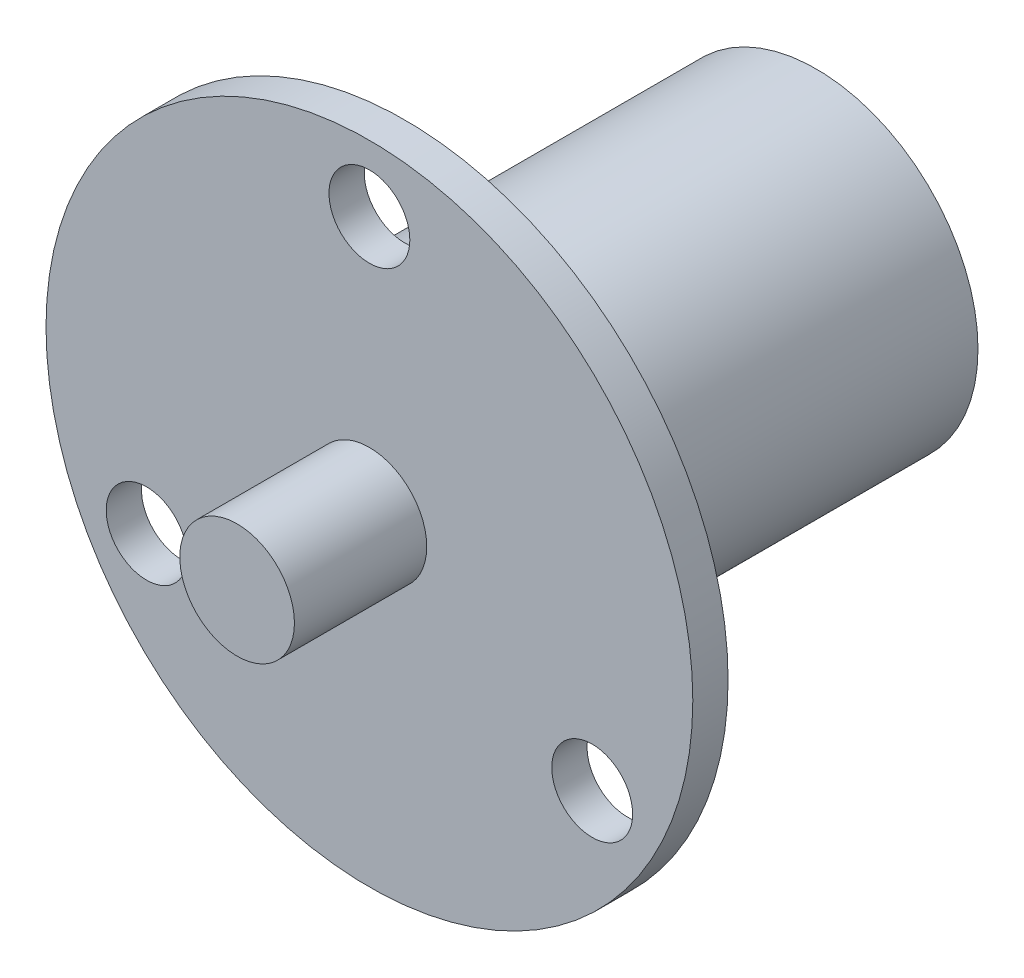
ISO-10303-21;
HEADER;
FILE_DESCRIPTION(('STEP AP214'),'2;1');
FILE_NAME('part.step','',(''),(''),'','','');
FILE_SCHEMA(('AUTOMOTIVE_DESIGN { 1 0 10303 214 1 1 1 1 }'));
ENDSEC;
DATA;
#1=APPLICATION_CONTEXT('core data for automotive mechanical design processes');
#2=APPLICATION_PROTOCOL_DEFINITION('international standard','automotive_design',2000,#1);
#3=PRODUCT_CONTEXT('',#1,'mechanical');
#4=PRODUCT('Part','Part','',(#3));
#5=PRODUCT_RELATED_PRODUCT_CATEGORY('part','',(#4));
#6=PRODUCT_DEFINITION_FORMATION('','',#4);
#7=PRODUCT_DEFINITION_CONTEXT('part definition',#1,'design');
#8=PRODUCT_DEFINITION('design','',#6,#7);
#9=PRODUCT_DEFINITION_SHAPE('','',#8);
#10=(LENGTH_UNIT() NAMED_UNIT(*) SI_UNIT(.MILLI.,.METRE.));
#11=(NAMED_UNIT(*) PLANE_ANGLE_UNIT() SI_UNIT($,.RADIAN.));
#12=(NAMED_UNIT(*) SI_UNIT($,.STERADIAN.) SOLID_ANGLE_UNIT());
#13=UNCERTAINTY_MEASURE_WITH_UNIT(LENGTH_MEASURE(1.E-05),#10,'distance_accuracy_value','');
#14=(GEOMETRIC_REPRESENTATION_CONTEXT(3) GLOBAL_UNCERTAINTY_ASSIGNED_CONTEXT((#13)) GLOBAL_UNIT_ASSIGNED_CONTEXT((#10,
#11,#12)) REPRESENTATION_CONTEXT('',''));
#15=CARTESIAN_POINT('',(0.,0.,0.));
#16=DIRECTION('',(0.,0.,1.));
#17=DIRECTION('',(1.,0.,0.));
#18=AXIS2_PLACEMENT_3D('',#15,#16,#17);
#19=CARTESIAN_POINT('',(0.,0.,-2.4));
#20=DIRECTION('',(0.,0.,1.));
#21=DIRECTION('',(1.,0.,0.));
#22=AXIS2_PLACEMENT_3D('',#19,#20,#21);
#23=PLANE('',#22);
#24=CARTESIAN_POINT('',(0.,0.,-2.4));
#25=DIRECTION('',(0.,0.,1.));
#26=DIRECTION('',(1.,0.,0.));
#27=AXIS2_PLACEMENT_3D('',#24,#25,#26);
#28=CIRCLE('',#27,22.);
#29=CARTESIAN_POINT('',(22.,0.,-2.4));
#30=VERTEX_POINT('',#29);
#31=EDGE_CURVE('E365',#30,#30,#28,.T.);
#32=ORIENTED_EDGE('',*,*,#31,.F.);
#33=EDGE_LOOP('',(#32));
#34=FACE_BOUND('',#33,.T.);
#35=CARTESIAN_POINT('',(0.,17.5,-2.4));
#36=DIRECTION('',(0.,0.,1.));
#37=DIRECTION('',(1.,0.,0.));
#38=AXIS2_PLACEMENT_3D('',#35,#36,#37);
#39=CIRCLE('',#38,2.75);
#40=CARTESIAN_POINT('',(2.75,17.5,-2.4));
#41=VERTEX_POINT('',#40);
#42=EDGE_CURVE('E373',#41,#41,#39,.T.);
#43=ORIENTED_EDGE('',*,*,#42,.T.);
#44=EDGE_LOOP('',(#43));
#45=FACE_BOUND('',#44,.T.);
#46=CARTESIAN_POINT('',(-15.1554445662276,-8.75000000000008,-2.4));
#47=DIRECTION('',(0.,0.,1.));
#48=DIRECTION('',(1.,0.,0.));
#49=AXIS2_PLACEMENT_3D('',#46,#47,#48);
#50=CIRCLE('',#49,2.75);
#51=CARTESIAN_POINT('',(-12.4054445662276,-8.75000000000008,-2.4));
#52=VERTEX_POINT('',#51);
#53=EDGE_CURVE('E381',#52,#52,#50,.T.);
#54=ORIENTED_EDGE('',*,*,#53,.T.);
#55=EDGE_LOOP('',(#54));
#56=FACE_BOUND('',#55,.T.);
#57=CARTESIAN_POINT('',(15.1554445662276,-8.75000000000007,-2.4));
#58=DIRECTION('',(0.,0.,1.));
#59=DIRECTION('',(1.,0.,0.));
#60=AXIS2_PLACEMENT_3D('',#57,#58,#59);
#61=CIRCLE('',#60,2.75);
#62=CARTESIAN_POINT('',(17.9054445662276,-8.75000000000007,-2.4));
#63=VERTEX_POINT('',#62);
#64=EDGE_CURVE('E387',#63,#63,#61,.T.);
#65=ORIENTED_EDGE('',*,*,#64,.T.);
#66=EDGE_LOOP('',(#65));
#67=FACE_BOUND('',#66,.T.);
#68=CARTESIAN_POINT('',(0.,0.,-2.4));
#69=DIRECTION('',(0.,0.,1.));
#70=DIRECTION('',(1.,0.,0.));
#71=AXIS2_PLACEMENT_3D('',#68,#69,#70);
#72=CIRCLE('',#71,11.);
#73=CARTESIAN_POINT('',(11.,0.,-2.4));
#74=VERTEX_POINT('',#73);
#75=EDGE_CURVE('E10',#74,#74,#72,.F.);
#76=ORIENTED_EDGE('',*,*,#75,.F.);
#77=EDGE_LOOP('',(#76));
#78=FACE_BOUND('',#77,.T.);
#79=ADVANCED_FACE('F358',(#34,#45,#56,#67,#78),#23,.F.);
#80=CARTESIAN_POINT('',(0.,0.,0.));
#81=DIRECTION('',(0.,0.,1.));
#82=DIRECTION('',(1.,0.,0.));
#83=AXIS2_PLACEMENT_3D('',#80,#81,#82);
#84=PLANE('',#83);
#85=CARTESIAN_POINT('',(0.,0.,0.));
#86=DIRECTION('',(0.,0.,1.));
#87=DIRECTION('',(1.,0.,0.));
#88=AXIS2_PLACEMENT_3D('',#85,#86,#87);
#89=CIRCLE('',#88,22.);
#90=CARTESIAN_POINT('',(22.,0.,0.));
#91=VERTEX_POINT('',#90);
#92=EDGE_CURVE('E369',#91,#91,#89,.T.);
#93=ORIENTED_EDGE('',*,*,#92,.T.);
#94=EDGE_LOOP('',(#93));
#95=FACE_BOUND('',#94,.T.);
#96=CARTESIAN_POINT('',(0.,17.5,0.));
#97=DIRECTION('',(0.,0.,1.));
#98=DIRECTION('',(1.,0.,0.));
#99=AXIS2_PLACEMENT_3D('',#96,#97,#98);
#100=CIRCLE('',#99,2.75);
#101=CARTESIAN_POINT('',(2.75,17.5,0.));
#102=VERTEX_POINT('',#101);
#103=EDGE_CURVE('E378',#102,#102,#100,.T.);
#104=ORIENTED_EDGE('',*,*,#103,.F.);
#105=EDGE_LOOP('',(#104));
#106=FACE_BOUND('',#105,.T.);
#107=CARTESIAN_POINT('',(-15.1554445662276,-8.75000000000008,0.));
#108=DIRECTION('',(0.,0.,1.));
#109=DIRECTION('',(1.,0.,0.));
#110=AXIS2_PLACEMENT_3D('',#107,#108,#109);
#111=CIRCLE('',#110,2.75);
#112=CARTESIAN_POINT('',(-12.4054445662276,-8.75000000000008,0.));
#113=VERTEX_POINT('',#112);
#114=EDGE_CURVE('E384',#113,#113,#111,.T.);
#115=ORIENTED_EDGE('',*,*,#114,.F.);
#116=EDGE_LOOP('',(#115));
#117=FACE_BOUND('',#116,.T.);
#118=CARTESIAN_POINT('',(15.1554445662276,-8.75000000000007,0.));
#119=DIRECTION('',(0.,0.,1.));
#120=DIRECTION('',(1.,0.,0.));
#121=AXIS2_PLACEMENT_3D('',#118,#119,#120);
#122=CIRCLE('',#121,2.75);
#123=CARTESIAN_POINT('',(17.9054445662276,-8.75000000000007,0.));
#124=VERTEX_POINT('',#123);
#125=EDGE_CURVE('E390',#124,#124,#122,.T.);
#126=ORIENTED_EDGE('',*,*,#125,.F.);
#127=EDGE_LOOP('',(#126));
#128=FACE_BOUND('',#127,.T.);
#129=CARTESIAN_POINT('',(0.,0.,0.));
#130=DIRECTION('',(0.,0.,1.));
#131=DIRECTION('',(1.,0.,0.));
#132=AXIS2_PLACEMENT_3D('',#129,#130,#131);
#133=CIRCLE('',#132,3.9);
#134=CARTESIAN_POINT('',(3.9,0.,0.));
#135=VERTEX_POINT('',#134);
#136=EDGE_CURVE('E396',#135,#135,#133,.T.);
#137=ORIENTED_EDGE('',*,*,#136,.F.);
#138=EDGE_LOOP('',(#137));
#139=FACE_BOUND('',#138,.T.);
#140=ADVANCED_FACE('F418',(#95,#106,#117,#128,#139),#84,.T.);
#141=CARTESIAN_POINT('',(0.,0.,-2.4));
#142=DIRECTION('',(0.,0.,1.));
#143=DIRECTION('',(1.,0.,0.));
#144=AXIS2_PLACEMENT_3D('',#141,#142,#143);
#145=CYLINDRICAL_SURFACE('',#144,22.);
#146=ORIENTED_EDGE('',*,*,#31,.T.);
#147=EDGE_LOOP('',(#146));
#148=FACE_BOUND('',#147,.T.);
#149=ORIENTED_EDGE('',*,*,#92,.F.);
#150=EDGE_LOOP('',(#149));
#151=FACE_BOUND('',#150,.T.);
#152=ADVANCED_FACE('F360',(#148,#151),#145,.T.);
#153=CARTESIAN_POINT('',(0.,17.5,-2.4));
#154=DIRECTION('',(0.,0.,1.));
#155=DIRECTION('',(1.,0.,0.));
#156=AXIS2_PLACEMENT_3D('',#153,#154,#155);
#157=CYLINDRICAL_SURFACE('',#156,2.75);
#158=ORIENTED_EDGE('',*,*,#42,.F.);
#159=EDGE_LOOP('',(#158));
#160=FACE_BOUND('',#159,.T.);
#161=ORIENTED_EDGE('',*,*,#103,.T.);
#162=EDGE_LOOP('',(#161));
#163=FACE_BOUND('',#162,.T.);
#164=ADVANCED_FACE('F427',(#160,#163),#157,.F.);
#165=CARTESIAN_POINT('',(-15.1554445662276,-8.75000000000008,-2.4));
#166=DIRECTION('',(0.,0.,1.));
#167=DIRECTION('',(1.,0.,0.));
#168=AXIS2_PLACEMENT_3D('',#165,#166,#167);
#169=CYLINDRICAL_SURFACE('',#168,2.75);
#170=ORIENTED_EDGE('',*,*,#53,.F.);
#171=EDGE_LOOP('',(#170));
#172=FACE_BOUND('',#171,.T.);
#173=ORIENTED_EDGE('',*,*,#114,.T.);
#174=EDGE_LOOP('',(#173));
#175=FACE_BOUND('',#174,.T.);
#176=ADVANCED_FACE('F430',(#172,#175),#169,.F.);
#177=CARTESIAN_POINT('',(15.1554445662276,-8.75000000000007,-2.4));
#178=DIRECTION('',(0.,0.,1.));
#179=DIRECTION('',(1.,0.,0.));
#180=AXIS2_PLACEMENT_3D('',#177,#178,#179);
#181=CYLINDRICAL_SURFACE('',#180,2.75);
#182=ORIENTED_EDGE('',*,*,#64,.F.);
#183=EDGE_LOOP('',(#182));
#184=FACE_BOUND('',#183,.T.);
#185=ORIENTED_EDGE('',*,*,#125,.T.);
#186=EDGE_LOOP('',(#185));
#187=FACE_BOUND('',#186,.T.);
#188=ADVANCED_FACE('F434',(#184,#187),#181,.F.);
#189=CARTESIAN_POINT('',(0.,0.,9.));
#190=DIRECTION('',(0.,0.,-1.));
#191=DIRECTION('',(-1.,0.,0.));
#192=AXIS2_PLACEMENT_3D('',#189,#190,#191);
#193=CYLINDRICAL_SURFACE('',#192,3.9);
#194=CARTESIAN_POINT('',(0.,0.,9.));
#195=DIRECTION('',(0.,0.,1.));
#196=DIRECTION('',(1.,0.,0.));
#197=AXIS2_PLACEMENT_3D('',#194,#195,#196);
#198=CIRCLE('',#197,3.9);
#199=CARTESIAN_POINT('',(3.9,0.,9.));
#200=VERTEX_POINT('',#199);
#201=EDGE_CURVE('E393',#200,#200,#198,.T.);
#202=ORIENTED_EDGE('',*,*,#201,.F.);
#203=EDGE_LOOP('',(#202));
#204=FACE_BOUND('',#203,.T.);
#205=ORIENTED_EDGE('',*,*,#136,.T.);
#206=EDGE_LOOP('',(#205));
#207=FACE_BOUND('',#206,.T.);
#208=ADVANCED_FACE('F415',(#204,#207),#193,.T.);
#209=CARTESIAN_POINT('',(0.,0.,9.));
#210=DIRECTION('',(0.,0.,1.));
#211=DIRECTION('',(1.,0.,0.));
#212=AXIS2_PLACEMENT_3D('',#209,#210,#211);
#213=PLANE('',#212);
#214=ORIENTED_EDGE('',*,*,#201,.T.);
#215=EDGE_LOOP('',(#214));
#216=FACE_BOUND('',#215,.T.);
#217=ADVANCED_FACE('F407',(#216),#213,.T.);
#218=CARTESIAN_POINT('',(0.,0.,-30.4));
#219=DIRECTION('',(0.,0.,1.));
#220=DIRECTION('',(1.,0.,0.));
#221=AXIS2_PLACEMENT_3D('',#218,#219,#220);
#222=CYLINDRICAL_SURFACE('',#221,11.);
#223=CARTESIAN_POINT('',(0.,0.,-30.4));
#224=DIRECTION('',(0.,0.,-1.));
#225=DIRECTION('',(-1.,0.,0.));
#226=AXIS2_PLACEMENT_3D('',#223,#224,#225);
#227=CIRCLE('',#226,11.);
#228=CARTESIAN_POINT('',(-11.,0.,-30.4));
#229=VERTEX_POINT('',#228);
#230=EDGE_CURVE('E399',#229,#229,#227,.T.);
#231=ORIENTED_EDGE('',*,*,#230,.F.);
#232=EDGE_LOOP('',(#231));
#233=FACE_BOUND('',#232,.T.);
#234=ORIENTED_EDGE('',*,*,#75,.T.);
#235=EDGE_LOOP('',(#234));
#236=FACE_BOUND('',#235,.T.);
#237=ADVANCED_FACE('F405',(#233,#236),#222,.T.);
#238=CARTESIAN_POINT('',(0.,0.,-30.4));
#239=DIRECTION('',(0.,0.,-1.));
#240=DIRECTION('',(-1.,0.,0.));
#241=AXIS2_PLACEMENT_3D('',#238,#239,#240);
#242=PLANE('',#241);
#243=ORIENTED_EDGE('',*,*,#230,.T.);
#244=EDGE_LOOP('',(#243));
#245=FACE_BOUND('',#244,.T.);
#246=ADVANCED_FACE('F403',(#245),#242,.T.);
#247=CLOSED_SHELL('',(#79,#140,#152,#164,#176,#188,#208,#217,#237,#246));
#248=MANIFOLD_SOLID_BREP('B2',#247);
#249=ADVANCED_BREP_SHAPE_REPRESENTATION('',(#18,#248),#14);
#250=SHAPE_DEFINITION_REPRESENTATION(#9,#249);
ENDSEC;
END-ISO-10303-21;
